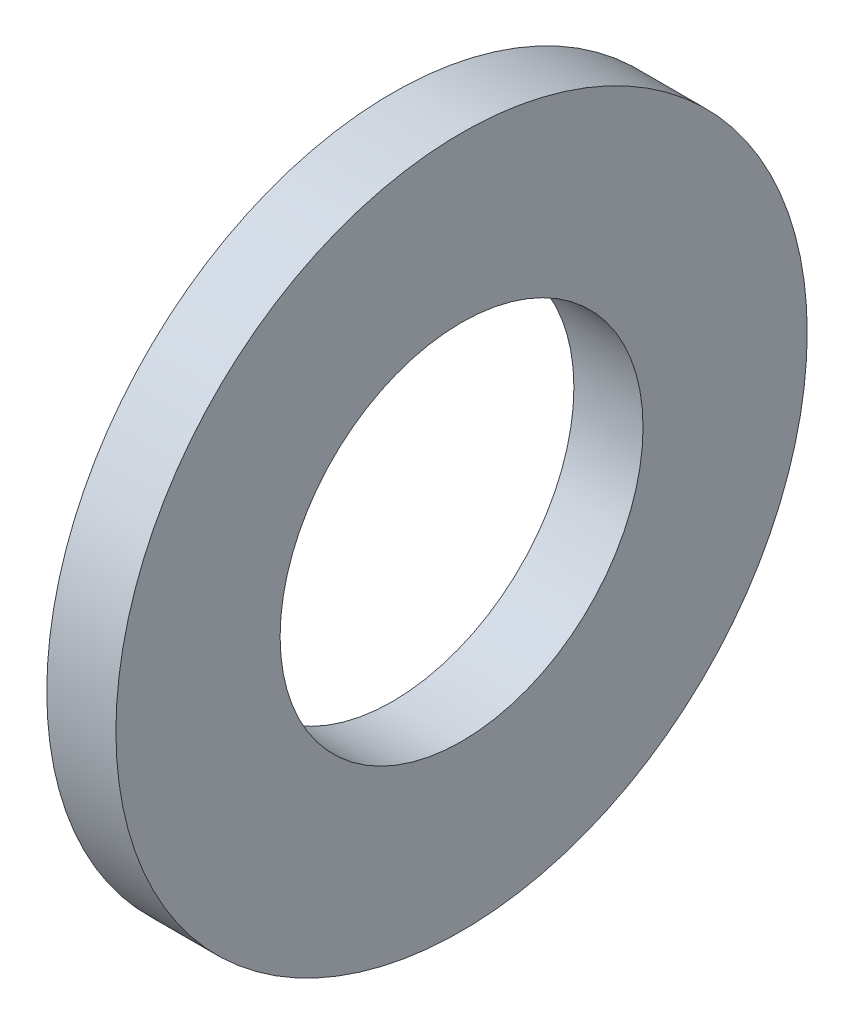
ISO-10303-21;
HEADER;
FILE_DESCRIPTION(('STEP AP214'),'2;1');
FILE_NAME('part.step','',(''),(''),'','','');
FILE_SCHEMA(('AUTOMOTIVE_DESIGN { 1 0 10303 214 1 1 1 1 }'));
ENDSEC;
DATA;
#1=APPLICATION_CONTEXT('core data for automotive mechanical design processes');
#2=APPLICATION_PROTOCOL_DEFINITION('international standard','automotive_design',2000,#1);
#3=PRODUCT_CONTEXT('',#1,'mechanical');
#4=PRODUCT('Part','Part','',(#3));
#5=PRODUCT_RELATED_PRODUCT_CATEGORY('part','',(#4));
#6=PRODUCT_DEFINITION_FORMATION('','',#4);
#7=PRODUCT_DEFINITION_CONTEXT('part definition',#1,'design');
#8=PRODUCT_DEFINITION('design','',#6,#7);
#9=PRODUCT_DEFINITION_SHAPE('','',#8);
#10=(LENGTH_UNIT() NAMED_UNIT(*) SI_UNIT(.MILLI.,.METRE.));
#11=(NAMED_UNIT(*) PLANE_ANGLE_UNIT() SI_UNIT($,.RADIAN.));
#12=(NAMED_UNIT(*) SI_UNIT($,.STERADIAN.) SOLID_ANGLE_UNIT());
#13=UNCERTAINTY_MEASURE_WITH_UNIT(LENGTH_MEASURE(1.E-05),#10,'distance_accuracy_value','');
#14=(GEOMETRIC_REPRESENTATION_CONTEXT(3) GLOBAL_UNCERTAINTY_ASSIGNED_CONTEXT((#13)) GLOBAL_UNIT_ASSIGNED_CONTEXT((#10,
#11,#12)) REPRESENTATION_CONTEXT('',''));
#15=CARTESIAN_POINT('',(0.,0.,0.));
#16=DIRECTION('',(0.,0.,1.));
#17=DIRECTION('',(1.,0.,0.));
#18=AXIS2_PLACEMENT_3D('',#15,#16,#17);
#19=CARTESIAN_POINT('',(1.6,0.,0.));
#20=DIRECTION('',(-1.,0.,0.));
#21=DIRECTION('',(0.,0.,1.));
#22=AXIS2_PLACEMENT_3D('',#19,#20,#21);
#23=PLANE('',#22);
#24=CARTESIAN_POINT('',(1.6,0.,0.));
#25=DIRECTION('',(1.,0.,0.));
#26=DIRECTION('',(0.,0.,-1.));
#27=AXIS2_PLACEMENT_3D('',#24,#25,#26);
#28=CIRCLE('',#27,4.2);
#29=CARTESIAN_POINT('',(1.6,0.,-4.2));
#30=VERTEX_POINT('',#29);
#31=EDGE_CURVE('E25',#30,#30,#28,.F.);
#32=ORIENTED_EDGE('',*,*,#31,.T.);
#33=EDGE_LOOP('',(#32));
#34=FACE_BOUND('',#33,.T.);
#35=CARTESIAN_POINT('',(1.6,0.,0.));
#36=DIRECTION('',(1.,0.,0.));
#37=DIRECTION('',(0.,0.,-1.));
#38=AXIS2_PLACEMENT_3D('',#35,#36,#37);
#39=CIRCLE('',#38,8.);
#40=CARTESIAN_POINT('',(1.6,0.,-8.));
#41=VERTEX_POINT('',#40);
#42=EDGE_CURVE('E16',#41,#41,#39,.F.);
#43=ORIENTED_EDGE('',*,*,#42,.F.);
#44=EDGE_LOOP('',(#43));
#45=FACE_BOUND('',#44,.T.);
#46=ADVANCED_FACE('F13',(#34,#45),#23,.F.);
#47=CARTESIAN_POINT('',(0.,0.,0.));
#48=DIRECTION('',(1.,0.,0.));
#49=DIRECTION('',(0.,0.,-1.));
#50=AXIS2_PLACEMENT_3D('',#47,#48,#49);
#51=CYLINDRICAL_SURFACE('',#50,8.);
#52=CARTESIAN_POINT('',(0.,0.,0.));
#53=DIRECTION('',(1.,0.,0.));
#54=DIRECTION('',(0.,0.,-1.));
#55=AXIS2_PLACEMENT_3D('',#52,#53,#54);
#56=CIRCLE('',#55,8.);
#57=CARTESIAN_POINT('',(0.,0.,-8.));
#58=VERTEX_POINT('',#57);
#59=EDGE_CURVE('E20',#58,#58,#56,.F.);
#60=ORIENTED_EDGE('',*,*,#59,.F.);
#61=EDGE_LOOP('',(#60));
#62=FACE_BOUND('',#61,.T.);
#63=ORIENTED_EDGE('',*,*,#42,.T.);
#64=EDGE_LOOP('',(#63));
#65=FACE_BOUND('',#64,.T.);
#66=ADVANCED_FACE('F33',(#62,#65),#51,.T.);
#67=CARTESIAN_POINT('',(0.,0.,0.));
#68=DIRECTION('',(1.,0.,0.));
#69=DIRECTION('',(0.,0.,-1.));
#70=AXIS2_PLACEMENT_3D('',#67,#68,#69);
#71=CYLINDRICAL_SURFACE('',#70,4.2);
#72=CARTESIAN_POINT('',(0.,0.,0.));
#73=DIRECTION('',(1.,0.,0.));
#74=DIRECTION('',(0.,0.,-1.));
#75=AXIS2_PLACEMENT_3D('',#72,#73,#74);
#76=CIRCLE('',#75,4.2);
#77=CARTESIAN_POINT('',(0.,0.,-4.2));
#78=VERTEX_POINT('',#77);
#79=EDGE_CURVE('E9',#78,#78,#76,.T.);
#80=ORIENTED_EDGE('',*,*,#79,.F.);
#81=EDGE_LOOP('',(#80));
#82=FACE_BOUND('',#81,.T.);
#83=ORIENTED_EDGE('',*,*,#31,.F.);
#84=EDGE_LOOP('',(#83));
#85=FACE_BOUND('',#84,.T.);
#86=ADVANCED_FACE('F40',(#82,#85),#71,.F.);
#87=CARTESIAN_POINT('',(0.,0.,0.));
#88=DIRECTION('',(-1.,0.,0.));
#89=DIRECTION('',(0.,0.,1.));
#90=AXIS2_PLACEMENT_3D('',#87,#88,#89);
#91=PLANE('',#90);
#92=ORIENTED_EDGE('',*,*,#79,.T.);
#93=EDGE_LOOP('',(#92));
#94=FACE_BOUND('',#93,.T.);
#95=ORIENTED_EDGE('',*,*,#59,.T.);
#96=EDGE_LOOP('',(#95));
#97=FACE_BOUND('',#96,.T.);
#98=ADVANCED_FACE('F42',(#94,#97),#91,.T.);
#99=CLOSED_SHELL('',(#46,#66,#86,#98));
#100=MANIFOLD_SOLID_BREP('B1',#99);
#101=ADVANCED_BREP_SHAPE_REPRESENTATION('',(#18,#100),#14);
#102=SHAPE_DEFINITION_REPRESENTATION(#9,#101);
ENDSEC;
END-ISO-10303-21;
